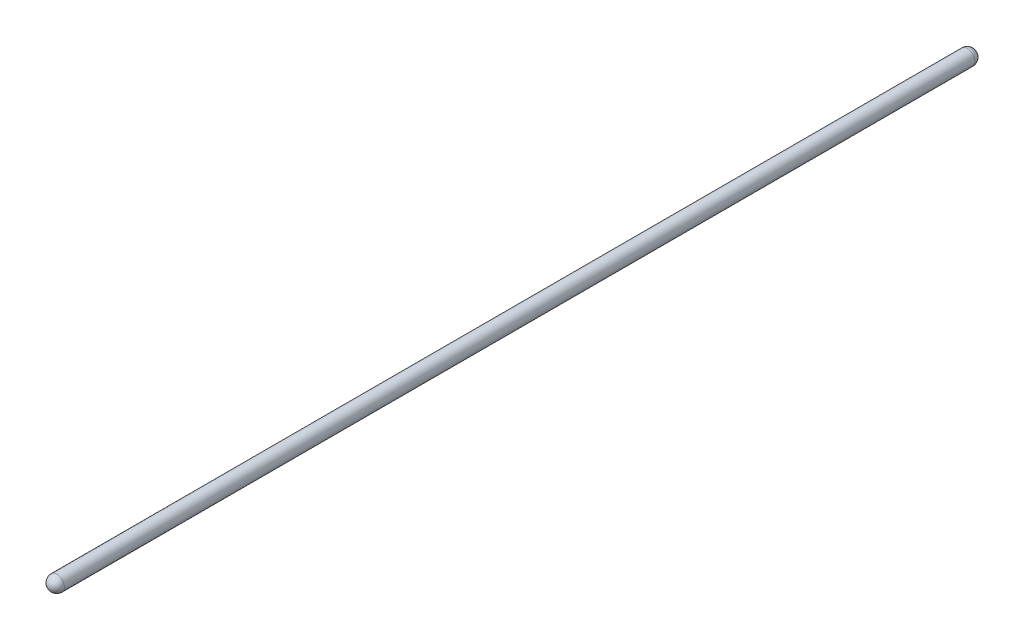
ISO-10303-21;
HEADER;
FILE_DESCRIPTION(('STEP AP214'),'2;1');
FILE_NAME('part.step','',(''),(''),'','','');
FILE_SCHEMA(('AUTOMOTIVE_DESIGN { 1 0 10303 214 1 1 1 1 }'));
ENDSEC;
DATA;
#1=APPLICATION_CONTEXT('core data for automotive mechanical design processes');
#2=APPLICATION_PROTOCOL_DEFINITION('international standard','automotive_design',2000,#1);
#3=PRODUCT_CONTEXT('',#1,'mechanical');
#4=PRODUCT('Part','Part','',(#3));
#5=PRODUCT_RELATED_PRODUCT_CATEGORY('part','',(#4));
#6=PRODUCT_DEFINITION_FORMATION('','',#4);
#7=PRODUCT_DEFINITION_CONTEXT('part definition',#1,'design');
#8=PRODUCT_DEFINITION('design','',#6,#7);
#9=PRODUCT_DEFINITION_SHAPE('','',#8);
#10=(LENGTH_UNIT() NAMED_UNIT(*) SI_UNIT(.MILLI.,.METRE.));
#11=(NAMED_UNIT(*) PLANE_ANGLE_UNIT() SI_UNIT($,.RADIAN.));
#12=(NAMED_UNIT(*) SI_UNIT($,.STERADIAN.) SOLID_ANGLE_UNIT());
#13=UNCERTAINTY_MEASURE_WITH_UNIT(LENGTH_MEASURE(1.E-05),#10,'distance_accuracy_value','');
#14=(GEOMETRIC_REPRESENTATION_CONTEXT(3) GLOBAL_UNCERTAINTY_ASSIGNED_CONTEXT((#13)) GLOBAL_UNIT_ASSIGNED_CONTEXT((#10,
#11,#12)) REPRESENTATION_CONTEXT('',''));
#15=CARTESIAN_POINT('',(0.,0.,0.));
#16=DIRECTION('',(0.,0.,1.));
#17=DIRECTION('',(1.,0.,0.));
#18=AXIS2_PLACEMENT_3D('',#15,#16,#17);
#19=CARTESIAN_POINT('',(0.,0.,0.));
#20=DIRECTION('',(0.,0.,-1.));
#21=DIRECTION('',(1.,0.,0.));
#22=AXIS2_PLACEMENT_3D('',#19,#20,#21);
#23=SPHERICAL_SURFACE('',#22,9.525);
#24=CARTESIAN_POINT('',(0.,0.,0.));
#25=DIRECTION('',(0.,0.,-1.));
#26=DIRECTION('',(-1.,0.,0.));
#27=AXIS2_PLACEMENT_3D('',#24,#25,#26);
#28=CIRCLE('',#27,9.525);
#29=CARTESIAN_POINT('',(-9.525,0.,0.));
#30=VERTEX_POINT('',#29);
#31=EDGE_CURVE('E10',#30,#30,#28,.T.);
#32=ORIENTED_EDGE('',*,*,#31,.T.);
#33=EDGE_LOOP('',(#32));
#34=FACE_BOUND('',#33,.T.);
#35=ADVANCED_FACE('F31',(#34),#23,.T.);
#36=CARTESIAN_POINT('',(0.,0.,-9.525));
#37=DIRECTION('',(0.,0.,-1.));
#38=DIRECTION('',(-1.,0.,0.));
#39=AXIS2_PLACEMENT_3D('',#36,#37,#38);
#40=CYLINDRICAL_SURFACE('',#39,9.52500000000002);
#41=ORIENTED_EDGE('',*,*,#31,.F.);
#42=EDGE_LOOP('',(#41));
#43=FACE_BOUND('',#42,.T.);
#44=CARTESIAN_POINT('',(1.40624756660042E-13,0.,1138.76328));
#45=DIRECTION('',(0.,0.,-1.));
#46=DIRECTION('',(-1.,0.,0.));
#47=AXIS2_PLACEMENT_3D('',#44,#45,#46);
#48=CIRCLE('',#47,9.52500000000004);
#49=CARTESIAN_POINT('',(-9.5249999999999,0.,1138.76328));
#50=VERTEX_POINT('',#49);
#51=EDGE_CURVE('E37',#50,#50,#48,.T.);
#52=ORIENTED_EDGE('',*,*,#51,.T.);
#53=EDGE_LOOP('',(#52));
#54=FACE_BOUND('',#53,.T.);
#55=ADVANCED_FACE('F43',(#43,#54),#40,.T.);
#56=CARTESIAN_POINT('',(0.,0.,1138.76328));
#57=DIRECTION('',(0.,0.,-1.));
#58=DIRECTION('',(1.,0.,0.));
#59=AXIS2_PLACEMENT_3D('',#56,#57,#58);
#60=SPHERICAL_SURFACE('',#59,9.52500000000018);
#61=ORIENTED_EDGE('',*,*,#51,.F.);
#62=EDGE_LOOP('',(#61));
#63=FACE_BOUND('',#62,.T.);
#64=ADVANCED_FACE('F45',(#63),#60,.T.);
#65=CLOSED_SHELL('',(#35,#55,#64));
#66=MANIFOLD_SOLID_BREP('B2',#65);
#67=ADVANCED_BREP_SHAPE_REPRESENTATION('',(#18,#66),#14);
#68=SHAPE_DEFINITION_REPRESENTATION(#9,#67);
ENDSEC;
END-ISO-10303-21;
